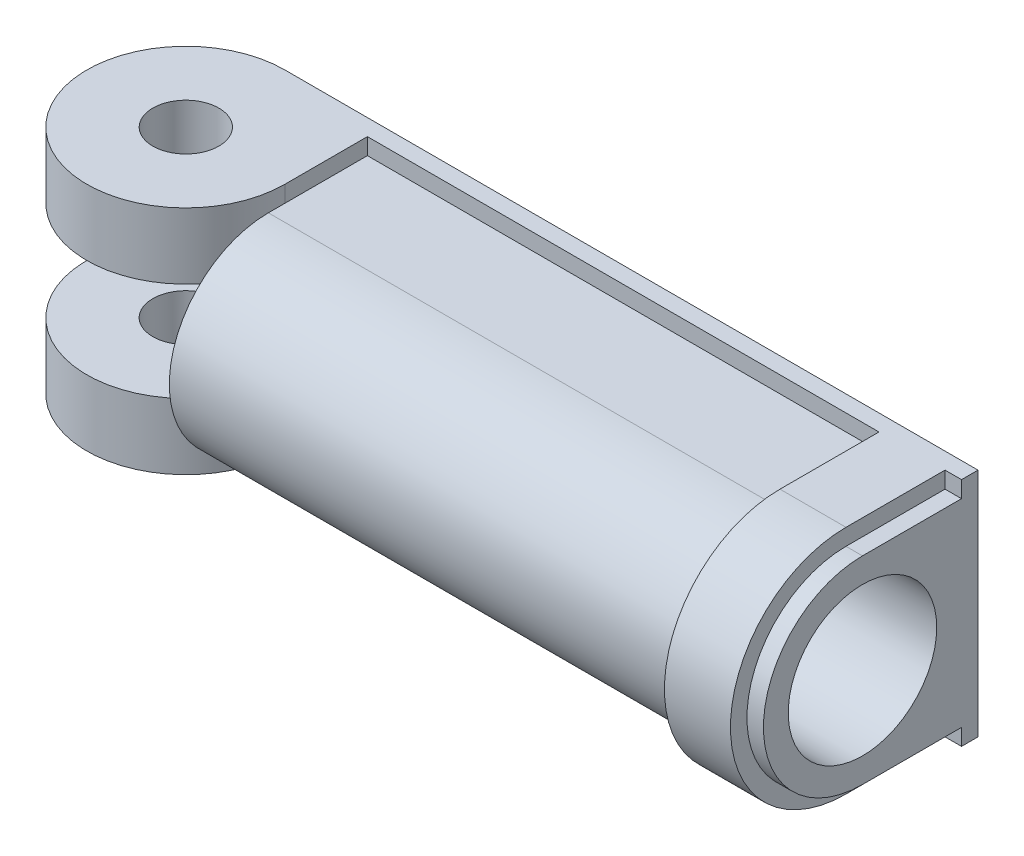
ISO-10303-21;
HEADER;
FILE_DESCRIPTION(('STEP AP214'),'2;1');
FILE_NAME('part.step','',(''),(''),'','','');
FILE_SCHEMA(('AUTOMOTIVE_DESIGN { 1 0 10303 214 1 1 1 1 }'));
ENDSEC;
DATA;
#1=APPLICATION_CONTEXT('core data for automotive mechanical design processes');
#2=APPLICATION_PROTOCOL_DEFINITION('international standard','automotive_design',2000,#1);
#3=PRODUCT_CONTEXT('',#1,'mechanical');
#4=PRODUCT('Part','Part','',(#3));
#5=PRODUCT_RELATED_PRODUCT_CATEGORY('part','',(#4));
#6=PRODUCT_DEFINITION_FORMATION('','',#4);
#7=PRODUCT_DEFINITION_CONTEXT('part definition',#1,'design');
#8=PRODUCT_DEFINITION('design','',#6,#7);
#9=PRODUCT_DEFINITION_SHAPE('','',#8);
#10=(LENGTH_UNIT() NAMED_UNIT(*) SI_UNIT(.MILLI.,.METRE.));
#11=(NAMED_UNIT(*) PLANE_ANGLE_UNIT() SI_UNIT($,.RADIAN.));
#12=(NAMED_UNIT(*) SI_UNIT($,.STERADIAN.) SOLID_ANGLE_UNIT());
#13=UNCERTAINTY_MEASURE_WITH_UNIT(LENGTH_MEASURE(1.E-05),#10,'distance_accuracy_value','');
#14=(GEOMETRIC_REPRESENTATION_CONTEXT(3) GLOBAL_UNCERTAINTY_ASSIGNED_CONTEXT((#13)) GLOBAL_UNIT_ASSIGNED_CONTEXT((#10,
#11,#12)) REPRESENTATION_CONTEXT('',''));
#15=CARTESIAN_POINT('',(0.,0.,0.));
#16=DIRECTION('',(0.,0.,1.));
#17=DIRECTION('',(1.,0.,0.));
#18=AXIS2_PLACEMENT_3D('',#15,#16,#17);
#19=CARTESIAN_POINT('',(-56.45658,10.97788,-10.97788));
#20=DIRECTION('',(0.,0.,-1.));
#21=DIRECTION('',(0.,1.,0.));
#22=AXIS2_PLACEMENT_3D('',#19,#20,#21);
#23=PLANE('',#22);
#24=DIRECTION('',(0.,-1.,0.));
#25=VECTOR('',#24,1.);
#26=CARTESIAN_POINT('',(-53.3945994739611,10.97788,-10.97788));
#27=LINE('',#26,#25);
#28=CARTESIAN_POINT('',(-53.3945994739611,3.71895707565416,-10.97788));
#29=VERTEX_POINT('',#28);
#30=CARTESIAN_POINT('',(-53.3945994739611,-10.97788,-10.97788));
#31=VERTEX_POINT('',#30);
#32=EDGE_CURVE('E406',#29,#31,#27,.T.);
#33=ORIENTED_EDGE('',*,*,#32,.F.);
#34=DIRECTION('',(0.500000000000005,0.866025403784436,0.));
#35=VECTOR('',#34,1.);
#36=CARTESIAN_POINT('',(-51.0168887771724,7.83727280819202,-10.97788));
#37=LINE('',#36,#35);
#38=CARTESIAN_POINT('',(-49.2036583695632,10.97788,-10.97788));
#39=VERTEX_POINT('',#38);
#40=EDGE_CURVE('E11',#29,#39,#37,.T.);
#41=ORIENTED_EDGE('',*,*,#40,.T.);
#42=DIRECTION('',(1.,0.,0.));
#43=VECTOR('',#42,1.);
#44=CARTESIAN_POINT('',(-56.45658,10.97788,-10.97788));
#45=LINE('',#44,#43);
#46=CARTESIAN_POINT('',(-40.3136583695632,10.97788,-10.97788));
#47=VERTEX_POINT('',#46);
#48=EDGE_CURVE('E372',#39,#47,#45,.T.);
#49=ORIENTED_EDGE('',*,*,#48,.T.);
#50=DIRECTION('',(0.500000000000005,0.866025403784436,0.));
#51=VECTOR('',#50,1.);
#52=CARTESIAN_POINT('',(-44.3493887771725,3.98778988837018,-10.97788));
#53=LINE('',#52,#51);
#54=CARTESIAN_POINT('',(-52.9898223158262,-10.97788,-10.97788));
#55=VERTEX_POINT('',#54);
#56=EDGE_CURVE('E45',#55,#47,#53,.T.);
#57=ORIENTED_EDGE('',*,*,#56,.F.);
#58=DIRECTION('',(1.,0.,0.));
#59=VECTOR('',#58,1.);
#60=CARTESIAN_POINT('',(-56.45658,-10.97788,-10.97788));
#61=LINE('',#60,#59);
#62=EDGE_CURVE('E377',#31,#55,#61,.T.);
#63=ORIENTED_EDGE('',*,*,#62,.F.);
#64=EDGE_LOOP('',(#33,#41,#49,#57,#63));
#65=FACE_BOUND('',#64,.T.);
#66=ADVANCED_FACE('F36',(#65),#23,.T.);
#67=CARTESIAN_POINT('',(-44.0998223158262,-10.97788,-10.97788));
#68=VERTEX_POINT('',#67);
#69=EDGE_CURVE('E378',#55,#68,#61,.T.);
#70=ORIENTED_EDGE('',*,*,#69,.F.);
#71=ORIENTED_EDGE('',*,*,#56,.T.);
#72=CARTESIAN_POINT('',(-31.4236583695632,10.97788,-10.97788));
#73=VERTEX_POINT('',#72);
#74=EDGE_CURVE('E442',#47,#73,#45,.T.);
#75=ORIENTED_EDGE('',*,*,#74,.T.);
#76=DIRECTION('',(0.500000000000005,0.866025403784436,0.));
#77=VECTOR('',#76,1.);
#78=CARTESIAN_POINT('',(-37.6818887771725,0.138306968548326,-10.97788));
#79=LINE('',#78,#77);
#80=EDGE_CURVE('E430',#68,#73,#79,.T.);
#81=ORIENTED_EDGE('',*,*,#80,.F.);
#82=EDGE_LOOP('',(#70,#71,#75,#81));
#83=FACE_BOUND('',#82,.T.);
#84=ADVANCED_FACE('F440',(#83),#23,.T.);
#85=CARTESIAN_POINT('',(-35.2098223158262,-10.97788,-10.97788));
#86=VERTEX_POINT('',#85);
#87=EDGE_CURVE('E518',#68,#86,#61,.T.);
#88=ORIENTED_EDGE('',*,*,#87,.F.);
#89=ORIENTED_EDGE('',*,*,#80,.T.);
#90=CARTESIAN_POINT('',(-22.5336583695632,10.97788,-10.97788));
#91=VERTEX_POINT('',#90);
#92=EDGE_CURVE('E450',#73,#91,#45,.T.);
#93=ORIENTED_EDGE('',*,*,#92,.T.);
#94=DIRECTION('',(0.500000000000005,0.866025403784436,0.));
#95=VECTOR('',#94,1.);
#96=CARTESIAN_POINT('',(-31.0143887771726,-3.71117595127353,-10.97788));
#97=LINE('',#96,#95);
#98=EDGE_CURVE('E426',#86,#91,#97,.T.);
#99=ORIENTED_EDGE('',*,*,#98,.F.);
#100=EDGE_LOOP('',(#88,#89,#93,#99));
#101=FACE_BOUND('',#100,.T.);
#102=ADVANCED_FACE('F532',(#101),#23,.T.);
#103=CARTESIAN_POINT('',(-26.3198223158262,-10.97788,-10.97788));
#104=VERTEX_POINT('',#103);
#105=EDGE_CURVE('E519',#86,#104,#61,.T.);
#106=ORIENTED_EDGE('',*,*,#105,.F.);
#107=ORIENTED_EDGE('',*,*,#98,.T.);
#108=CARTESIAN_POINT('',(-13.6436583695632,10.97788,-10.97788));
#109=VERTEX_POINT('',#108);
#110=EDGE_CURVE('E451',#91,#109,#45,.T.);
#111=ORIENTED_EDGE('',*,*,#110,.T.);
#112=DIRECTION('',(0.500000000000005,0.866025403784436,0.));
#113=VECTOR('',#112,1.);
#114=CARTESIAN_POINT('',(-24.3468887771726,-7.56065887109538,-10.97788));
#115=LINE('',#114,#113);
#116=EDGE_CURVE('E422',#104,#109,#115,.T.);
#117=ORIENTED_EDGE('',*,*,#116,.F.);
#118=EDGE_LOOP('',(#106,#107,#111,#117));
#119=FACE_BOUND('',#118,.T.);
#120=ADVANCED_FACE('F526',(#119),#23,.T.);
#121=CARTESIAN_POINT('',(-17.4298223158262,-10.97788,-10.97788));
#122=VERTEX_POINT('',#121);
#123=EDGE_CURVE('E517',#104,#122,#61,.T.);
#124=ORIENTED_EDGE('',*,*,#123,.F.);
#125=ORIENTED_EDGE('',*,*,#116,.T.);
#126=CARTESIAN_POINT('',(-4.75365836956324,10.97788,-10.97788));
#127=VERTEX_POINT('',#126);
#128=EDGE_CURVE('E454',#109,#127,#45,.T.);
#129=ORIENTED_EDGE('',*,*,#128,.T.);
#130=DIRECTION('',(0.500000000000005,0.866025403784436,0.));
#131=VECTOR('',#130,1.);
#132=CARTESIAN_POINT('',(-17.6793887771727,-11.4101417909172,-10.97788));
#133=LINE('',#132,#131);
#134=EDGE_CURVE('E418',#122,#127,#133,.T.);
#135=ORIENTED_EDGE('',*,*,#134,.F.);
#136=EDGE_LOOP('',(#124,#125,#129,#135));
#137=FACE_BOUND('',#136,.T.);
#138=ADVANCED_FACE('F524',(#137),#23,.T.);
#139=CARTESIAN_POINT('',(-8.53982231582622,-10.97788,-10.97788));
#140=VERTEX_POINT('',#139);
#141=EDGE_CURVE('E512',#122,#140,#61,.T.);
#142=ORIENTED_EDGE('',*,*,#141,.F.);
#143=ORIENTED_EDGE('',*,*,#134,.T.);
#144=CARTESIAN_POINT('',(0.,10.97788,-10.97788));
#145=VERTEX_POINT('',#144);
#146=EDGE_CURVE('E376',#127,#145,#45,.T.);
#147=ORIENTED_EDGE('',*,*,#146,.T.);
#148=DIRECTION('',(0.,1.,0.));
#149=VECTOR('',#148,1.);
#150=CARTESIAN_POINT('',(0.,10.97788,-10.97788));
#151=LINE('',#150,#149);
#152=CARTESIAN_POINT('',(0.,3.81352613862136,-10.97788));
#153=VERTEX_POINT('',#152);
#154=EDGE_CURVE('E364',#153,#145,#151,.T.);
#155=ORIENTED_EDGE('',*,*,#154,.F.);
#156=DIRECTION('',(0.500000000000005,0.866025403784436,0.));
#157=VECTOR('',#156,1.);
#158=CARTESIAN_POINT('',(-11.0118887771727,-15.2596247107391,-10.97788));
#159=LINE('',#158,#157);
#160=EDGE_CURVE('E415',#140,#153,#159,.T.);
#161=ORIENTED_EDGE('',*,*,#160,.F.);
#162=EDGE_LOOP('',(#142,#143,#147,#155,#161));
#163=FACE_BOUND('',#162,.T.);
#164=ADVANCED_FACE('F510',(#163),#23,.T.);
#165=CARTESIAN_POINT('',(0.,-10.97788,-10.97788));
#166=VERTEX_POINT('',#165);
#167=EDGE_CURVE('E381',#140,#166,#61,.T.);
#168=ORIENTED_EDGE('',*,*,#167,.F.);
#169=ORIENTED_EDGE('',*,*,#160,.T.);
#170=EDGE_CURVE('E330',#166,#153,#151,.T.);
#171=ORIENTED_EDGE('',*,*,#170,.F.);
#172=EDGE_LOOP('',(#168,#169,#171));
#173=FACE_BOUND('',#172,.T.);
#174=ADVANCED_FACE('F514',(#173),#23,.T.);
#175=CARTESIAN_POINT('',(-65.86728,10.97788,-10.97788));
#176=VERTEX_POINT('',#175);
#177=CARTESIAN_POINT('',(-53.3945994739611,10.97788,-10.97788));
#178=VERTEX_POINT('',#177);
#179=EDGE_CURVE('E367',#176,#178,#45,.T.);
#180=ORIENTED_EDGE('',*,*,#179,.T.);
#181=EDGE_CURVE('E411',#178,#29,#27,.T.);
#182=ORIENTED_EDGE('',*,*,#181,.T.);
#183=ORIENTED_EDGE('',*,*,#32,.T.);
#184=CARTESIAN_POINT('',(-65.86728,-10.97788,-10.97788));
#185=VERTEX_POINT('',#184);
#186=EDGE_CURVE('E373',#185,#31,#61,.T.);
#187=ORIENTED_EDGE('',*,*,#186,.F.);
#188=DIRECTION('',(0.,-1.,0.));
#189=VECTOR('',#188,1.);
#190=CARTESIAN_POINT('',(-65.86728,-4.70408,-10.97788));
#191=LINE('',#190,#189);
#192=CARTESIAN_POINT('',(-65.86728,-4.70408,-10.97788));
#193=VERTEX_POINT('',#192);
#194=EDGE_CURVE('E244',#193,#185,#191,.T.);
#195=ORIENTED_EDGE('',*,*,#194,.F.);
#196=DIRECTION('',(-1.,0.,0.));
#197=VECTOR('',#196,1.);
#198=CARTESIAN_POINT('',(-56.45658,-4.70408,-10.97788));
#199=LINE('',#198,#197);
#200=CARTESIAN_POINT('',(-56.45658,-4.70408,-10.97788));
#201=VERTEX_POINT('',#200);
#202=EDGE_CURVE('E230',#201,#193,#199,.T.);
#203=ORIENTED_EDGE('',*,*,#202,.F.);
#204=DIRECTION('',(0.,1.,0.));
#205=VECTOR('',#204,1.);
#206=CARTESIAN_POINT('',(-56.45658,10.97788,-10.97788));
#207=LINE('',#206,#205);
#208=CARTESIAN_POINT('',(-56.45658,4.70408,-10.97788));
#209=VERTEX_POINT('',#208);
#210=EDGE_CURVE('E248',#201,#209,#207,.T.);
#211=ORIENTED_EDGE('',*,*,#210,.T.);
#212=DIRECTION('',(-1.,0.,0.));
#213=VECTOR('',#212,1.);
#214=CARTESIAN_POINT('',(-56.45658,4.70408,-10.97788));
#215=LINE('',#214,#213);
#216=CARTESIAN_POINT('',(-65.86728,4.70408,-10.97788));
#217=VERTEX_POINT('',#216);
#218=EDGE_CURVE('E266',#209,#217,#215,.T.);
#219=ORIENTED_EDGE('',*,*,#218,.T.);
#220=DIRECTION('',(0.,1.,0.));
#221=VECTOR('',#220,1.);
#222=CARTESIAN_POINT('',(-65.86728,4.70408,-10.97788));
#223=LINE('',#222,#221);
#224=EDGE_CURVE('E273',#217,#176,#223,.T.);
#225=ORIENTED_EDGE('',*,*,#224,.T.);
#226=EDGE_LOOP('',(#180,#182,#183,#187,#195,#203,#211,#219,#225));
#227=FACE_BOUND('',#226,.T.);
#228=ADVANCED_FACE('F466',(#227),#23,.T.);
#229=CARTESIAN_POINT('',(-56.45658,0.,0.));
#230=DIRECTION('',(1.,0.,0.));
#231=DIRECTION('',(0.,0.,-1.));
#232=AXIS2_PLACEMENT_3D('',#229,#230,#231);
#233=PLANE('',#232);
#234=DIRECTION('',(0.,-1.,0.));
#235=VECTOR('',#234,1.);
#236=CARTESIAN_POINT('',(-56.45658,-4.70408,-1.56718));
#237=LINE('',#236,#235);
#238=CARTESIAN_POINT('',(-56.45658,-4.70408,-1.56718));
#239=VERTEX_POINT('',#238);
#240=CARTESIAN_POINT('',(-56.45658,-9.4107,-1.56718));
#241=VERTEX_POINT('',#240);
#242=EDGE_CURVE('E237',#239,#241,#237,.T.);
#243=ORIENTED_EDGE('',*,*,#242,.T.);
#244=DIRECTION('',(0.,0.,-1.));
#245=VECTOR('',#244,1.);
#246=CARTESIAN_POINT('',(-56.45658,-9.4107,0.));
#247=LINE('',#246,#245);
#248=CARTESIAN_POINT('',(-56.45658,-9.4107,0.));
#249=VERTEX_POINT('',#248);
#250=EDGE_CURVE('E337',#249,#241,#247,.T.);
#251=ORIENTED_EDGE('',*,*,#250,.F.);
#252=CARTESIAN_POINT('',(-56.45658,0.,0.));
#253=DIRECTION('',(1.,0.,0.));
#254=DIRECTION('',(0.,0.,-1.));
#255=AXIS2_PLACEMENT_3D('',#252,#253,#254);
#256=CIRCLE('',#255,9.4107);
#257=CARTESIAN_POINT('',(-56.45658,9.4107,0.));
#258=VERTEX_POINT('',#257);
#259=EDGE_CURVE('E334',#258,#249,#256,.T.);
#260=ORIENTED_EDGE('',*,*,#259,.F.);
#261=DIRECTION('',(0.,0.,1.));
#262=VECTOR('',#261,1.);
#263=CARTESIAN_POINT('',(-56.45658,9.4107,0.));
#264=LINE('',#263,#262);
#265=CARTESIAN_POINT('',(-56.45658,9.4107,-1.56718));
#266=VERTEX_POINT('',#265);
#267=EDGE_CURVE('E329',#266,#258,#264,.T.);
#268=ORIENTED_EDGE('',*,*,#267,.F.);
#269=DIRECTION('',(0.,1.,0.));
#270=VECTOR('',#269,1.);
#271=CARTESIAN_POINT('',(-56.45658,4.70408,-1.56718));
#272=LINE('',#271,#270);
#273=CARTESIAN_POINT('',(-56.45658,4.70408,-1.56718));
#274=VERTEX_POINT('',#273);
#275=EDGE_CURVE('E277',#274,#266,#272,.T.);
#276=ORIENTED_EDGE('',*,*,#275,.F.);
#277=DIRECTION('',(0.,0.,-1.));
#278=VECTOR('',#277,1.);
#279=CARTESIAN_POINT('',(-56.45658,4.70408,-1.56718));
#280=LINE('',#279,#278);
#281=EDGE_CURVE('E264',#274,#209,#280,.T.);
#282=ORIENTED_EDGE('',*,*,#281,.T.);
#283=ORIENTED_EDGE('',*,*,#210,.F.);
#284=DIRECTION('',(0.,0.,-1.));
#285=VECTOR('',#284,1.);
#286=CARTESIAN_POINT('',(-56.45658,-4.70408,-1.56718));
#287=LINE('',#286,#285);
#288=EDGE_CURVE('E228',#239,#201,#287,.T.);
#289=ORIENTED_EDGE('',*,*,#288,.F.);
#290=EDGE_LOOP('',(#243,#251,#260,#268,#276,#282,#283,#289));
#291=FACE_BOUND('',#290,.T.);
#292=ADVANCED_FACE('F246',(#291),#233,.F.);
#293=CARTESIAN_POINT('',(-56.45658,-9.4107,-9.41069999999999));
#294=DIRECTION('',(0.,0.,1.));
#295=DIRECTION('',(1.,0.,0.));
#296=AXIS2_PLACEMENT_3D('',#293,#294,#295);
#297=PLANE('',#296);
#298=DIRECTION('',(1.,0.,0.));
#299=VECTOR('',#298,1.);
#300=CARTESIAN_POINT('',(-56.45658,-10.97788,-9.41069999999999));
#301=LINE('',#300,#299);
#302=CARTESIAN_POINT('',(-56.45658,-10.97788,-9.41069999999999));
#303=VERTEX_POINT('',#302);
#304=CARTESIAN_POINT('',(-7.84098,-10.97788,-9.41069999999999));
#305=VERTEX_POINT('',#304);
#306=EDGE_CURVE('E379',#303,#305,#301,.T.);
#307=ORIENTED_EDGE('',*,*,#306,.T.);
#308=DIRECTION('',(0.,1.,0.));
#309=VECTOR('',#308,1.);
#310=CARTESIAN_POINT('',(-7.84098,10.97788,-9.41069999999999));
#311=LINE('',#310,#309);
#312=CARTESIAN_POINT('',(-7.84098,-9.4107,-9.41069999999999));
#313=VERTEX_POINT('',#312);
#314=EDGE_CURVE('E284',#305,#313,#311,.T.);
#315=ORIENTED_EDGE('',*,*,#314,.T.);
#316=DIRECTION('',(1.,0.,0.));
#317=VECTOR('',#316,1.);
#318=CARTESIAN_POINT('',(-56.45658,-9.4107,-9.41069999999999));
#319=LINE('',#318,#317);
#320=CARTESIAN_POINT('',(-56.45658,-9.4107,-9.41069999999999));
#321=VERTEX_POINT('',#320);
#322=EDGE_CURVE('E383',#321,#313,#319,.T.);
#323=ORIENTED_EDGE('',*,*,#322,.F.);
#324=DIRECTION('',(0.,-1.,0.));
#325=VECTOR('',#324,1.);
#326=CARTESIAN_POINT('',(-56.45658,-9.4107,-9.41069999999999));
#327=LINE('',#326,#325);
#328=EDGE_CURVE('E339',#321,#303,#327,.T.);
#329=ORIENTED_EDGE('',*,*,#328,.T.);
#330=EDGE_LOOP('',(#307,#315,#323,#329));
#331=FACE_BOUND('',#330,.T.);
#332=ADVANCED_FACE('F552',(#331),#297,.T.);
#333=CARTESIAN_POINT('',(-56.45658,-9.4107,0.));
#334=DIRECTION('',(0.,-1.,0.));
#335=DIRECTION('',(0.,0.,-1.));
#336=AXIS2_PLACEMENT_3D('',#333,#334,#335);
#337=PLANE('',#336);
#338=ORIENTED_EDGE('',*,*,#322,.T.);
#339=DIRECTION('',(0.,0.,1.));
#340=VECTOR('',#339,1.);
#341=CARTESIAN_POINT('',(-7.84098,-9.4107,0.));
#342=LINE('',#341,#340);
#343=CARTESIAN_POINT('',(-7.84098,-9.4107,0.));
#344=VERTEX_POINT('',#343);
#345=EDGE_CURVE('E323',#313,#344,#342,.T.);
#346=ORIENTED_EDGE('',*,*,#345,.T.);
#347=DIRECTION('',(1.,0.,0.));
#348=VECTOR('',#347,1.);
#349=CARTESIAN_POINT('',(-56.45658,-9.4107,0.));
#350=LINE('',#349,#348);
#351=EDGE_CURVE('E387',#249,#344,#350,.T.);
#352=ORIENTED_EDGE('',*,*,#351,.F.);
#353=ORIENTED_EDGE('',*,*,#250,.T.);
#354=DIRECTION('',(0.,0.,-1.));
#355=VECTOR('',#354,1.);
#356=CARTESIAN_POINT('',(-56.45658,-9.4107,0.));
#357=LINE('',#356,#355);
#358=EDGE_CURVE('E259',#241,#321,#357,.T.);
#359=ORIENTED_EDGE('',*,*,#358,.T.);
#360=EDGE_LOOP('',(#338,#346,#352,#353,#359));
#361=FACE_BOUND('',#360,.T.);
#362=ADVANCED_FACE('F617',(#361),#337,.T.);
#363=CARTESIAN_POINT('',(-56.45658,0.,0.));
#364=DIRECTION('',(1.,0.,0.));
#365=DIRECTION('',(0.,0.,-1.));
#366=AXIS2_PLACEMENT_3D('',#363,#364,#365);
#367=CYLINDRICAL_SURFACE('',#366,9.4107);
#368=ORIENTED_EDGE('',*,*,#351,.T.);
#369=CARTESIAN_POINT('',(-7.84098,0.,0.));
#370=DIRECTION('',(1.,0.,0.));
#371=DIRECTION('',(0.,0.,-1.));
#372=AXIS2_PLACEMENT_3D('',#369,#370,#371);
#373=CIRCLE('',#372,9.4107);
#374=CARTESIAN_POINT('',(-7.84098,9.4107,0.));
#375=VERTEX_POINT('',#374);
#376=EDGE_CURVE('E321',#344,#375,#373,.F.);
#377=ORIENTED_EDGE('',*,*,#376,.T.);
#378=DIRECTION('',(1.,0.,0.));
#379=VECTOR('',#378,1.);
#380=CARTESIAN_POINT('',(-56.45658,9.4107,0.));
#381=LINE('',#380,#379);
#382=EDGE_CURVE('E391',#258,#375,#381,.T.);
#383=ORIENTED_EDGE('',*,*,#382,.F.);
#384=ORIENTED_EDGE('',*,*,#259,.T.);
#385=EDGE_LOOP('',(#368,#377,#383,#384));
#386=FACE_BOUND('',#385,.T.);
#387=ADVANCED_FACE('F608',(#386),#367,.T.);
#388=CARTESIAN_POINT('',(-56.45658,9.4107,0.));
#389=DIRECTION('',(0.,1.,0.));
#390=DIRECTION('',(0.,0.,1.));
#391=AXIS2_PLACEMENT_3D('',#388,#389,#390);
#392=PLANE('',#391);
#393=ORIENTED_EDGE('',*,*,#382,.T.);
#394=DIRECTION('',(0.,0.,-1.));
#395=VECTOR('',#394,1.);
#396=CARTESIAN_POINT('',(-7.84098,9.4107,0.));
#397=LINE('',#396,#395);
#398=CARTESIAN_POINT('',(-7.84098,9.4107,-9.41069999999999));
#399=VERTEX_POINT('',#398);
#400=EDGE_CURVE('E319',#375,#399,#397,.T.);
#401=ORIENTED_EDGE('',*,*,#400,.T.);
#402=DIRECTION('',(1.,0.,0.));
#403=VECTOR('',#402,1.);
#404=CARTESIAN_POINT('',(-56.45658,9.4107,-9.41069999999999));
#405=LINE('',#404,#403);
#406=CARTESIAN_POINT('',(-56.45658,9.4107,-9.41069999999999));
#407=VERTEX_POINT('',#406);
#408=EDGE_CURVE('E395',#407,#399,#405,.T.);
#409=ORIENTED_EDGE('',*,*,#408,.F.);
#410=EDGE_CURVE('E331',#407,#266,#264,.T.);
#411=ORIENTED_EDGE('',*,*,#410,.T.);
#412=ORIENTED_EDGE('',*,*,#267,.T.);
#413=EDGE_LOOP('',(#393,#401,#409,#411,#412));
#414=FACE_BOUND('',#413,.T.);
#415=ADVANCED_FACE('F601',(#414),#392,.T.);
#416=CARTESIAN_POINT('',(-56.45658,10.97788,-9.41069999999999));
#417=DIRECTION('',(0.,0.,1.));
#418=DIRECTION('',(1.,0.,0.));
#419=AXIS2_PLACEMENT_3D('',#416,#417,#418);
#420=PLANE('',#419);
#421=ORIENTED_EDGE('',*,*,#408,.T.);
#422=DIRECTION('',(0.,1.,0.));
#423=VECTOR('',#422,1.);
#424=CARTESIAN_POINT('',(-7.84098,10.97788,-9.41069999999999));
#425=LINE('',#424,#423);
#426=CARTESIAN_POINT('',(-7.84098,10.97788,-9.41069999999999));
#427=VERTEX_POINT('',#426);
#428=EDGE_CURVE('E404',#399,#427,#425,.T.);
#429=ORIENTED_EDGE('',*,*,#428,.T.);
#430=DIRECTION('',(1.,0.,0.));
#431=VECTOR('',#430,1.);
#432=CARTESIAN_POINT('',(-56.45658,10.97788,-9.41069999999999));
#433=LINE('',#432,#431);
#434=CARTESIAN_POINT('',(-56.45658,10.97788,-9.41069999999999));
#435=VERTEX_POINT('',#434);
#436=EDGE_CURVE('E399',#435,#427,#433,.T.);
#437=ORIENTED_EDGE('',*,*,#436,.F.);
#438=DIRECTION('',(0.,-1.,0.));
#439=VECTOR('',#438,1.);
#440=CARTESIAN_POINT('',(-56.45658,10.97788,-9.41069999999999));
#441=LINE('',#440,#439);
#442=EDGE_CURVE('E326',#435,#407,#441,.T.);
#443=ORIENTED_EDGE('',*,*,#442,.T.);
#444=EDGE_LOOP('',(#421,#429,#437,#443));
#445=FACE_BOUND('',#444,.T.);
#446=ADVANCED_FACE('F480',(#445),#420,.T.);
#447=CARTESIAN_POINT('',(-56.45658,10.97788,-10.97788));
#448=DIRECTION('',(0.,1.,0.));
#449=DIRECTION('',(0.,0.,1.));
#450=AXIS2_PLACEMENT_3D('',#447,#448,#449);
#451=PLANE('',#450);
#452=CARTESIAN_POINT('',(-65.86728,10.97788,-1.56718));
#453=DIRECTION('',(0.,1.,0.));
#454=DIRECTION('',(0.,0.,1.));
#455=AXIS2_PLACEMENT_3D('',#452,#453,#454);
#456=CIRCLE('',#455,3.13689999999999);
#457=CARTESIAN_POINT('',(-65.86728,10.97788,1.56971999999999));
#458=VERTEX_POINT('',#457);
#459=EDGE_CURVE('E885',#458,#458,#456,.T.);
#460=ORIENTED_EDGE('',*,*,#459,.F.);
#461=EDGE_LOOP('',(#460));
#462=FACE_BOUND('',#461,.T.);
#463=DIRECTION('',(0.,0.,1.));
#464=VECTOR('',#463,1.);
#465=CARTESIAN_POINT('',(0.,10.97788,-10.97788));
#466=LINE('',#465,#464);
#467=CARTESIAN_POINT('',(0.,10.97788,-9.41069999999999));
#468=VERTEX_POINT('',#467);
#469=EDGE_CURVE('E325',#145,#468,#466,.T.);
#470=ORIENTED_EDGE('',*,*,#469,.F.);
#471=ORIENTED_EDGE('',*,*,#146,.F.);
#472=ORIENTED_EDGE('',*,*,#128,.F.);
#473=ORIENTED_EDGE('',*,*,#110,.F.);
#474=ORIENTED_EDGE('',*,*,#92,.F.);
#475=ORIENTED_EDGE('',*,*,#74,.F.);
#476=ORIENTED_EDGE('',*,*,#48,.F.);
#477=EDGE_CURVE('E371',#178,#39,#45,.T.);
#478=ORIENTED_EDGE('',*,*,#477,.F.);
#479=ORIENTED_EDGE('',*,*,#179,.F.);
#480=CARTESIAN_POINT('',(-65.86728,10.97788,-1.56718));
#481=DIRECTION('',(0.,1.,0.));
#482=DIRECTION('',(0.,0.,1.));
#483=AXIS2_PLACEMENT_3D('',#480,#481,#482);
#484=CIRCLE('',#483,9.41069999999999);
#485=CARTESIAN_POINT('',(-56.45658,10.97788,-1.56718));
#486=VERTEX_POINT('',#485);
#487=EDGE_CURVE('E267',#176,#486,#484,.T.);
#488=ORIENTED_EDGE('',*,*,#487,.T.);
#489=DIRECTION('',(0.,0.,-1.));
#490=VECTOR('',#489,1.);
#491=CARTESIAN_POINT('',(-56.45658,10.97788,-1.56718));
#492=LINE('',#491,#490);
#493=EDGE_CURVE('E263',#486,#435,#492,.T.);
#494=ORIENTED_EDGE('',*,*,#493,.T.);
#495=ORIENTED_EDGE('',*,*,#436,.T.);
#496=DIRECTION('',(0.,0.,1.));
#497=VECTOR('',#496,1.);
#498=CARTESIAN_POINT('',(-7.84098,10.97788,-9.41069999999999));
#499=LINE('',#498,#497);
#500=CARTESIAN_POINT('',(-7.84098,10.97788,0.));
#501=VERTEX_POINT('',#500);
#502=EDGE_CURVE('E286',#427,#501,#499,.T.);
#503=ORIENTED_EDGE('',*,*,#502,.T.);
#504=DIRECTION('',(1.,0.,0.));
#505=VECTOR('',#504,1.);
#506=CARTESIAN_POINT('',(-7.84098,10.97788,0.));
#507=LINE('',#506,#505);
#508=CARTESIAN_POINT('',(-1.56718,10.97788,0.));
#509=VERTEX_POINT('',#508);
#510=EDGE_CURVE('E296',#501,#509,#507,.T.);
#511=ORIENTED_EDGE('',*,*,#510,.T.);
#512=DIRECTION('',(0.,0.,1.));
#513=VECTOR('',#512,1.);
#514=CARTESIAN_POINT('',(-1.56718,10.97788,-9.41069999999999));
#515=LINE('',#514,#513);
#516=CARTESIAN_POINT('',(-1.56718,10.97788,-9.41069999999999));
#517=VERTEX_POINT('',#516);
#518=EDGE_CURVE('E299',#517,#509,#515,.T.);
#519=ORIENTED_EDGE('',*,*,#518,.F.);
#520=EDGE_CURVE('E343',#517,#468,#433,.T.);
#521=ORIENTED_EDGE('',*,*,#520,.T.);
#522=EDGE_LOOP('',(#470,#471,#472,#473,#474,#475,#476,#478,#479,#488,#494,#495,#503,#511,#519,#521));
#523=FACE_BOUND('',#522,.T.);
#524=ADVANCED_FACE('F38',(#462,#523),#451,.T.);
#525=ORIENTED_EDGE('',*,*,#40,.F.);
#526=ORIENTED_EDGE('',*,*,#181,.F.);
#527=ORIENTED_EDGE('',*,*,#477,.T.);
#528=EDGE_LOOP('',(#525,#526,#527));
#529=FACE_BOUND('',#528,.T.);
#530=ADVANCED_FACE('F464',(#529),#23,.T.);
#531=CARTESIAN_POINT('',(-56.45658,-10.97788,-10.97788));
#532=DIRECTION('',(0.,-1.,0.));
#533=DIRECTION('',(0.,0.,-1.));
#534=AXIS2_PLACEMENT_3D('',#531,#532,#533);
#535=PLANE('',#534);
#536=CARTESIAN_POINT('',(-65.86728,-10.97788,-1.56718));
#537=DIRECTION('',(0.,1.,0.));
#538=DIRECTION('',(0.,0.,1.));
#539=AXIS2_PLACEMENT_3D('',#536,#537,#538);
#540=CIRCLE('',#539,3.13689999999999);
#541=CARTESIAN_POINT('',(-65.86728,-10.97788,1.56971999999999));
#542=VERTEX_POINT('',#541);
#543=EDGE_CURVE('E410',#542,#542,#540,.T.);
#544=ORIENTED_EDGE('',*,*,#543,.T.);
#545=EDGE_LOOP('',(#544));
#546=FACE_BOUND('',#545,.T.);
#547=DIRECTION('',(0.,0.,-1.));
#548=VECTOR('',#547,1.);
#549=CARTESIAN_POINT('',(0.,-10.97788,-10.97788));
#550=LINE('',#549,#548);
#551=CARTESIAN_POINT('',(0.,-10.97788,-9.41069999999999));
#552=VERTEX_POINT('',#551);
#553=EDGE_CURVE('E361',#552,#166,#550,.T.);
#554=ORIENTED_EDGE('',*,*,#553,.F.);
#555=CARTESIAN_POINT('',(-1.56718,-10.97788,-9.41069999999999));
#556=VERTEX_POINT('',#555);
#557=EDGE_CURVE('E382',#556,#552,#301,.T.);
#558=ORIENTED_EDGE('',*,*,#557,.F.);
#559=DIRECTION('',(0.,0.,-1.));
#560=VECTOR('',#559,1.);
#561=CARTESIAN_POINT('',(-1.56718,-10.97788,-9.41069999999999));
#562=LINE('',#561,#560);
#563=CARTESIAN_POINT('',(-1.56718,-10.97788,0.));
#564=VERTEX_POINT('',#563);
#565=EDGE_CURVE('E287',#564,#556,#562,.T.);
#566=ORIENTED_EDGE('',*,*,#565,.F.);
#567=DIRECTION('',(1.,0.,0.));
#568=VECTOR('',#567,1.);
#569=CARTESIAN_POINT('',(-7.84098,-10.97788,0.));
#570=LINE('',#569,#568);
#571=CARTESIAN_POINT('',(-7.84098,-10.97788,0.));
#572=VERTEX_POINT('',#571);
#573=EDGE_CURVE('E307',#572,#564,#570,.T.);
#574=ORIENTED_EDGE('',*,*,#573,.F.);
#575=DIRECTION('',(0.,0.,-1.));
#576=VECTOR('',#575,1.);
#577=CARTESIAN_POINT('',(-7.84098,-10.97788,-9.41069999999999));
#578=LINE('',#577,#576);
#579=EDGE_CURVE('E293',#572,#305,#578,.T.);
#580=ORIENTED_EDGE('',*,*,#579,.T.);
#581=ORIENTED_EDGE('',*,*,#306,.F.);
#582=DIRECTION('',(0.,0.,-1.));
#583=VECTOR('',#582,1.);
#584=CARTESIAN_POINT('',(-56.45658,-10.97788,-1.56718));
#585=LINE('',#584,#583);
#586=CARTESIAN_POINT('',(-56.45658,-10.97788,-1.56718));
#587=VERTEX_POINT('',#586);
#588=EDGE_CURVE('E251',#587,#303,#585,.T.);
#589=ORIENTED_EDGE('',*,*,#588,.F.);
#590=CARTESIAN_POINT('',(-65.86728,-10.97788,-1.56718));
#591=DIRECTION('',(0.,1.,0.));
#592=DIRECTION('',(0.,0.,1.));
#593=AXIS2_PLACEMENT_3D('',#590,#591,#592);
#594=CIRCLE('',#593,9.41069999999999);
#595=EDGE_CURVE('E249',#185,#587,#594,.T.);
#596=ORIENTED_EDGE('',*,*,#595,.F.);
#597=ORIENTED_EDGE('',*,*,#186,.T.);
#598=ORIENTED_EDGE('',*,*,#62,.T.);
#599=ORIENTED_EDGE('',*,*,#69,.T.);
#600=ORIENTED_EDGE('',*,*,#87,.T.);
#601=ORIENTED_EDGE('',*,*,#105,.T.);
#602=ORIENTED_EDGE('',*,*,#123,.T.);
#603=ORIENTED_EDGE('',*,*,#141,.T.);
#604=ORIENTED_EDGE('',*,*,#167,.T.);
#605=EDGE_LOOP('',(#554,#558,#566,#574,#580,#581,#589,#596,#597,#598,#599,#600,#601,#602,#603,#604));
#606=FACE_BOUND('',#605,.T.);
#607=ADVANCED_FACE('F523',(#546,#606),#535,.T.);
#608=DIRECTION('',(0.,1.,0.));
#609=VECTOR('',#608,1.);
#610=CARTESIAN_POINT('',(-1.56718,10.97788,-9.41069999999999));
#611=LINE('',#610,#609);
#612=CARTESIAN_POINT('',(-1.56718,-9.4107,-9.41069999999999));
#613=VERTEX_POINT('',#612);
#614=EDGE_CURVE('E280',#556,#613,#611,.T.);
#615=ORIENTED_EDGE('',*,*,#614,.F.);
#616=ORIENTED_EDGE('',*,*,#557,.T.);
#617=DIRECTION('',(0.,-1.,0.));
#618=VECTOR('',#617,1.);
#619=CARTESIAN_POINT('',(0.,-9.4107,-9.41069999999999));
#620=LINE('',#619,#618);
#621=CARTESIAN_POINT('',(0.,-9.4107,-9.41069999999999));
#622=VERTEX_POINT('',#621);
#623=EDGE_CURVE('E358',#622,#552,#620,.T.);
#624=ORIENTED_EDGE('',*,*,#623,.F.);
#625=EDGE_CURVE('E386',#613,#622,#319,.T.);
#626=ORIENTED_EDGE('',*,*,#625,.F.);
#627=EDGE_LOOP('',(#615,#616,#624,#626));
#628=FACE_BOUND('',#627,.T.);
#629=ADVANCED_FACE('F544',(#628),#297,.T.);
#630=DIRECTION('',(0.,0.,1.));
#631=VECTOR('',#630,1.);
#632=CARTESIAN_POINT('',(-1.56718,-9.4107,0.));
#633=LINE('',#632,#631);
#634=CARTESIAN_POINT('',(-1.56718,-9.4107,0.));
#635=VERTEX_POINT('',#634);
#636=EDGE_CURVE('E316',#613,#635,#633,.T.);
#637=ORIENTED_EDGE('',*,*,#636,.F.);
#638=ORIENTED_EDGE('',*,*,#625,.T.);
#639=DIRECTION('',(0.,0.,-1.));
#640=VECTOR('',#639,1.);
#641=CARTESIAN_POINT('',(0.,-9.4107,0.));
#642=LINE('',#641,#640);
#643=CARTESIAN_POINT('',(0.,-9.4107,0.));
#644=VERTEX_POINT('',#643);
#645=EDGE_CURVE('E355',#644,#622,#642,.T.);
#646=ORIENTED_EDGE('',*,*,#645,.F.);
#647=EDGE_CURVE('E390',#635,#644,#350,.T.);
#648=ORIENTED_EDGE('',*,*,#647,.F.);
#649=EDGE_LOOP('',(#637,#638,#646,#648));
#650=FACE_BOUND('',#649,.T.);
#651=ADVANCED_FACE('F629',(#650),#337,.T.);
#652=CARTESIAN_POINT('',(-1.56718,0.,0.));
#653=DIRECTION('',(1.,0.,0.));
#654=DIRECTION('',(0.,0.,-1.));
#655=AXIS2_PLACEMENT_3D('',#652,#653,#654);
#656=CIRCLE('',#655,9.4107);
#657=CARTESIAN_POINT('',(-1.56718,9.4107,0.));
#658=VERTEX_POINT('',#657);
#659=EDGE_CURVE('E313',#635,#658,#656,.F.);
#660=ORIENTED_EDGE('',*,*,#659,.F.);
#661=ORIENTED_EDGE('',*,*,#647,.T.);
#662=CARTESIAN_POINT('',(0.,0.,0.));
#663=DIRECTION('',(1.,0.,0.));
#664=DIRECTION('',(0.,0.,-1.));
#665=AXIS2_PLACEMENT_3D('',#662,#663,#664);
#666=CIRCLE('',#665,9.4107);
#667=CARTESIAN_POINT('',(0.,9.4107,0.));
#668=VERTEX_POINT('',#667);
#669=EDGE_CURVE('E352',#668,#644,#666,.T.);
#670=ORIENTED_EDGE('',*,*,#669,.F.);
#671=EDGE_CURVE('E394',#658,#668,#381,.T.);
#672=ORIENTED_EDGE('',*,*,#671,.F.);
#673=EDGE_LOOP('',(#660,#661,#670,#672));
#674=FACE_BOUND('',#673,.T.);
#675=ADVANCED_FACE('F620',(#674),#367,.T.);
#676=DIRECTION('',(0.,0.,-1.));
#677=VECTOR('',#676,1.);
#678=CARTESIAN_POINT('',(-1.56718,9.4107,0.));
#679=LINE('',#678,#677);
#680=CARTESIAN_POINT('',(-1.56718,9.4107,-9.41069999999999));
#681=VERTEX_POINT('',#680);
#682=EDGE_CURVE('E309',#658,#681,#679,.T.);
#683=ORIENTED_EDGE('',*,*,#682,.F.);
#684=ORIENTED_EDGE('',*,*,#671,.T.);
#685=DIRECTION('',(0.,0.,1.));
#686=VECTOR('',#685,1.);
#687=CARTESIAN_POINT('',(0.,9.4107,0.));
#688=LINE('',#687,#686);
#689=CARTESIAN_POINT('',(0.,9.4107,-9.41069999999999));
#690=VERTEX_POINT('',#689);
#691=EDGE_CURVE('E349',#690,#668,#688,.T.);
#692=ORIENTED_EDGE('',*,*,#691,.F.);
#693=EDGE_CURVE('E398',#681,#690,#405,.T.);
#694=ORIENTED_EDGE('',*,*,#693,.F.);
#695=EDGE_LOOP('',(#683,#684,#692,#694));
#696=FACE_BOUND('',#695,.T.);
#697=ADVANCED_FACE('F502',(#696),#392,.T.);
#698=DIRECTION('',(0.,1.,0.));
#699=VECTOR('',#698,1.);
#700=CARTESIAN_POINT('',(-1.56718,10.97788,-9.41069999999999));
#701=LINE('',#700,#699);
#702=EDGE_CURVE('E370',#681,#517,#701,.T.);
#703=ORIENTED_EDGE('',*,*,#702,.F.);
#704=ORIENTED_EDGE('',*,*,#693,.T.);
#705=DIRECTION('',(0.,-1.,0.));
#706=VECTOR('',#705,1.);
#707=CARTESIAN_POINT('',(0.,10.97788,-9.41069999999999));
#708=LINE('',#707,#706);
#709=EDGE_CURVE('E346',#468,#690,#708,.T.);
#710=ORIENTED_EDGE('',*,*,#709,.F.);
#711=ORIENTED_EDGE('',*,*,#520,.F.);
#712=EDGE_LOOP('',(#703,#704,#710,#711));
#713=FACE_BOUND('',#712,.T.);
#714=ADVANCED_FACE('F498',(#713),#420,.T.);
#715=CARTESIAN_POINT('',(0.,0.,0.));
#716=DIRECTION('',(1.,0.,0.));
#717=DIRECTION('',(0.,0.,-1.));
#718=AXIS2_PLACEMENT_3D('',#715,#716,#717);
#719=PLANE('',#718);
#720=CARTESIAN_POINT('',(0.,0.,0.));
#721=DIRECTION('',(1.,0.,0.));
#722=DIRECTION('',(0.,0.,-1.));
#723=AXIS2_PLACEMENT_3D('',#720,#721,#722);
#724=CIRCLE('',#723,7.05612);
#725=CARTESIAN_POINT('',(0.,0.,-7.05612));
#726=VERTEX_POINT('',#725);
#727=EDGE_CURVE('E886',#726,#726,#724,.T.);
#728=ORIENTED_EDGE('',*,*,#727,.F.);
#729=EDGE_LOOP('',(#728));
#730=FACE_BOUND('',#729,.T.);
#731=ORIENTED_EDGE('',*,*,#469,.T.);
#732=ORIENTED_EDGE('',*,*,#709,.T.);
#733=ORIENTED_EDGE('',*,*,#691,.T.);
#734=ORIENTED_EDGE('',*,*,#669,.T.);
#735=ORIENTED_EDGE('',*,*,#645,.T.);
#736=ORIENTED_EDGE('',*,*,#623,.T.);
#737=ORIENTED_EDGE('',*,*,#553,.T.);
#738=ORIENTED_EDGE('',*,*,#170,.T.);
#739=ORIENTED_EDGE('',*,*,#154,.T.);
#740=EDGE_LOOP('',(#731,#732,#733,#734,#735,#736,#737,#738,#739));
#741=FACE_BOUND('',#740,.T.);
#742=ADVANCED_FACE('F506',(#730,#741),#719,.T.);
#743=CARTESIAN_POINT('',(-7.84098,0.,0.));
#744=DIRECTION('',(1.,0.,0.));
#745=DIRECTION('',(0.,0.,-1.));
#746=AXIS2_PLACEMENT_3D('',#743,#744,#745);
#747=CYLINDRICAL_SURFACE('',#746,10.97788);
#748=CARTESIAN_POINT('',(-1.56718,0.,0.));
#749=DIRECTION('',(1.,0.,0.));
#750=DIRECTION('',(0.,0.,-1.));
#751=AXIS2_PLACEMENT_3D('',#748,#749,#750);
#752=CIRCLE('',#751,10.97788);
#753=EDGE_CURVE('E302',#509,#564,#752,.T.);
#754=ORIENTED_EDGE('',*,*,#753,.F.);
#755=ORIENTED_EDGE('',*,*,#510,.F.);
#756=CARTESIAN_POINT('',(-7.84098,0.,0.));
#757=DIRECTION('',(1.,0.,0.));
#758=DIRECTION('',(0.,0.,-1.));
#759=AXIS2_PLACEMENT_3D('',#756,#757,#758);
#760=CIRCLE('',#759,10.97788);
#761=EDGE_CURVE('E290',#501,#572,#760,.T.);
#762=ORIENTED_EDGE('',*,*,#761,.T.);
#763=ORIENTED_EDGE('',*,*,#573,.T.);
#764=EDGE_LOOP('',(#754,#755,#762,#763));
#765=FACE_BOUND('',#764,.T.);
#766=ADVANCED_FACE('F492',(#765),#747,.T.);
#767=CARTESIAN_POINT('',(-7.84098,0.,0.));
#768=DIRECTION('',(1.,0.,0.));
#769=DIRECTION('',(0.,0.,-1.));
#770=AXIS2_PLACEMENT_3D('',#767,#768,#769);
#771=PLANE('',#770);
#772=ORIENTED_EDGE('',*,*,#345,.F.);
#773=ORIENTED_EDGE('',*,*,#314,.F.);
#774=ORIENTED_EDGE('',*,*,#579,.F.);
#775=ORIENTED_EDGE('',*,*,#761,.F.);
#776=ORIENTED_EDGE('',*,*,#502,.F.);
#777=ORIENTED_EDGE('',*,*,#428,.F.);
#778=ORIENTED_EDGE('',*,*,#400,.F.);
#779=ORIENTED_EDGE('',*,*,#376,.F.);
#780=EDGE_LOOP('',(#772,#773,#774,#775,#776,#777,#778,#779));
#781=FACE_BOUND('',#780,.T.);
#782=ADVANCED_FACE('F485',(#781),#771,.F.);
#783=CARTESIAN_POINT('',(-1.56718,0.,0.));
#784=DIRECTION('',(1.,0.,0.));
#785=DIRECTION('',(0.,0.,-1.));
#786=AXIS2_PLACEMENT_3D('',#783,#784,#785);
#787=PLANE('',#786);
#788=ORIENTED_EDGE('',*,*,#614,.T.);
#789=ORIENTED_EDGE('',*,*,#636,.T.);
#790=ORIENTED_EDGE('',*,*,#659,.T.);
#791=ORIENTED_EDGE('',*,*,#682,.T.);
#792=ORIENTED_EDGE('',*,*,#702,.T.);
#793=ORIENTED_EDGE('',*,*,#518,.T.);
#794=ORIENTED_EDGE('',*,*,#753,.T.);
#795=ORIENTED_EDGE('',*,*,#565,.T.);
#796=EDGE_LOOP('',(#788,#789,#790,#791,#792,#793,#794,#795));
#797=FACE_BOUND('',#796,.T.);
#798=ADVANCED_FACE('F495',(#797),#787,.T.);
#799=CARTESIAN_POINT('',(-56.45658,4.70408,-1.56718));
#800=DIRECTION('',(1.,0.,0.));
#801=DIRECTION('',(0.,0.,-1.));
#802=AXIS2_PLACEMENT_3D('',#799,#800,#801);
#803=PLANE('',#802);
#804=EDGE_CURVE('E281',#266,#486,#272,.T.);
#805=ORIENTED_EDGE('',*,*,#804,.F.);
#806=ORIENTED_EDGE('',*,*,#410,.F.);
#807=ORIENTED_EDGE('',*,*,#442,.F.);
#808=ORIENTED_EDGE('',*,*,#493,.F.);
#809=EDGE_LOOP('',(#805,#806,#807,#808));
#810=FACE_BOUND('',#809,.T.);
#811=ADVANCED_FACE('F477',(#810),#803,.T.);
#812=CARTESIAN_POINT('',(-65.86728,4.70408,-1.56718));
#813=DIRECTION('',(0.,1.,0.));
#814=DIRECTION('',(0.,0.,1.));
#815=AXIS2_PLACEMENT_3D('',#812,#813,#814);
#816=CYLINDRICAL_SURFACE('',#815,9.41069999999999);
#817=ORIENTED_EDGE('',*,*,#487,.F.);
#818=ORIENTED_EDGE('',*,*,#224,.F.);
#819=CARTESIAN_POINT('',(-65.86728,4.70408,-1.56718));
#820=DIRECTION('',(0.,1.,0.));
#821=DIRECTION('',(0.,0.,1.));
#822=AXIS2_PLACEMENT_3D('',#819,#820,#821);
#823=CIRCLE('',#822,9.41069999999999);
#824=EDGE_CURVE('E270',#217,#274,#823,.T.);
#825=ORIENTED_EDGE('',*,*,#824,.T.);
#826=ORIENTED_EDGE('',*,*,#275,.T.);
#827=ORIENTED_EDGE('',*,*,#804,.T.);
#828=EDGE_LOOP('',(#817,#818,#825,#826,#827));
#829=FACE_BOUND('',#828,.T.);
#830=ADVANCED_FACE('F471',(#829),#816,.T.);
#831=CARTESIAN_POINT('',(-65.86728,4.70408,-1.56718));
#832=DIRECTION('',(0.,1.,0.));
#833=DIRECTION('',(0.,0.,1.));
#834=AXIS2_PLACEMENT_3D('',#831,#832,#833);
#835=PLANE('',#834);
#836=CARTESIAN_POINT('',(-65.86728,4.70408,-1.56718));
#837=DIRECTION('',(0.,1.,0.));
#838=DIRECTION('',(0.,0.,1.));
#839=AXIS2_PLACEMENT_3D('',#836,#837,#838);
#840=CIRCLE('',#839,3.13689999999999);
#841=CARTESIAN_POINT('',(-65.86728,4.70408,1.56971999999999));
#842=VERTEX_POINT('',#841);
#843=EDGE_CURVE('E254',#842,#842,#840,.T.);
#844=ORIENTED_EDGE('',*,*,#843,.T.);
#845=EDGE_LOOP('',(#844));
#846=FACE_BOUND('',#845,.T.);
#847=ORIENTED_EDGE('',*,*,#281,.F.);
#848=ORIENTED_EDGE('',*,*,#824,.F.);
#849=ORIENTED_EDGE('',*,*,#218,.F.);
#850=EDGE_LOOP('',(#847,#848,#849));
#851=FACE_BOUND('',#850,.T.);
#852=ADVANCED_FACE('F651',(#846,#851),#835,.F.);
#853=CARTESIAN_POINT('',(-56.45658,-4.70408,-1.56718));
#854=DIRECTION('',(-1.,0.,0.));
#855=DIRECTION('',(0.,0.,1.));
#856=AXIS2_PLACEMENT_3D('',#853,#854,#855);
#857=PLANE('',#856);
#858=ORIENTED_EDGE('',*,*,#328,.F.);
#859=ORIENTED_EDGE('',*,*,#358,.F.);
#860=EDGE_CURVE('E240',#241,#587,#237,.T.);
#861=ORIENTED_EDGE('',*,*,#860,.T.);
#862=ORIENTED_EDGE('',*,*,#588,.T.);
#863=EDGE_LOOP('',(#858,#859,#861,#862));
#864=FACE_BOUND('',#863,.T.);
#865=ADVANCED_FACE('F721',(#864),#857,.F.);
#866=CARTESIAN_POINT('',(-65.86728,-4.70408,-1.56718));
#867=DIRECTION('',(0.,-1.,0.));
#868=DIRECTION('',(0.,0.,-1.));
#869=AXIS2_PLACEMENT_3D('',#866,#867,#868);
#870=CYLINDRICAL_SURFACE('',#869,9.41069999999999);
#871=ORIENTED_EDGE('',*,*,#595,.T.);
#872=ORIENTED_EDGE('',*,*,#860,.F.);
#873=ORIENTED_EDGE('',*,*,#242,.F.);
#874=CARTESIAN_POINT('',(-65.86728,-4.70408,-1.56718));
#875=DIRECTION('',(0.,1.,0.));
#876=DIRECTION('',(0.,0.,1.));
#877=AXIS2_PLACEMENT_3D('',#874,#875,#876);
#878=CIRCLE('',#877,9.41069999999999);
#879=EDGE_CURVE('E224',#193,#239,#878,.T.);
#880=ORIENTED_EDGE('',*,*,#879,.F.);
#881=ORIENTED_EDGE('',*,*,#194,.T.);
#882=EDGE_LOOP('',(#871,#872,#873,#880,#881));
#883=FACE_BOUND('',#882,.T.);
#884=ADVANCED_FACE('F239',(#883),#870,.T.);
#885=CARTESIAN_POINT('',(-65.86728,-4.70408,-1.56718));
#886=DIRECTION('',(0.,-1.,0.));
#887=DIRECTION('',(0.,0.,1.));
#888=AXIS2_PLACEMENT_3D('',#885,#886,#887);
#889=PLANE('',#888);
#890=CARTESIAN_POINT('',(-65.86728,-4.70408,-1.56718));
#891=DIRECTION('',(0.,-1.,0.));
#892=DIRECTION('',(0.,0.,-1.));
#893=AXIS2_PLACEMENT_3D('',#890,#891,#892);
#894=CIRCLE('',#893,3.13689999999999);
#895=CARTESIAN_POINT('',(-65.86728,-4.70408,-4.70407999999999));
#896=VERTEX_POINT('',#895);
#897=EDGE_CURVE('E407',#896,#896,#894,.T.);
#898=ORIENTED_EDGE('',*,*,#897,.T.);
#899=EDGE_LOOP('',(#898));
#900=FACE_BOUND('',#899,.T.);
#901=ORIENTED_EDGE('',*,*,#288,.T.);
#902=ORIENTED_EDGE('',*,*,#202,.T.);
#903=ORIENTED_EDGE('',*,*,#879,.T.);
#904=EDGE_LOOP('',(#901,#902,#903));
#905=FACE_BOUND('',#904,.T.);
#906=ADVANCED_FACE('F226',(#900,#905),#889,.F.);
#907=CARTESIAN_POINT('',(-65.86728,-10.97788,-1.56718));
#908=DIRECTION('',(0.,1.,0.));
#909=DIRECTION('',(0.,0.,1.));
#910=AXIS2_PLACEMENT_3D('',#907,#908,#909);
#911=CYLINDRICAL_SURFACE('',#910,3.13689999999999);
#912=ORIENTED_EDGE('',*,*,#543,.F.);
#913=EDGE_LOOP('',(#912));
#914=FACE_BOUND('',#913,.T.);
#915=ORIENTED_EDGE('',*,*,#897,.F.);
#916=EDGE_LOOP('',(#915));
#917=FACE_BOUND('',#916,.T.);
#918=ADVANCED_FACE('F742',(#914,#917),#911,.F.);
#919=ORIENTED_EDGE('',*,*,#459,.T.);
#920=EDGE_LOOP('',(#919));
#921=FACE_BOUND('',#920,.T.);
#922=ORIENTED_EDGE('',*,*,#843,.F.);
#923=EDGE_LOOP('',(#922));
#924=FACE_BOUND('',#923,.T.);
#925=ADVANCED_FACE('F751',(#921,#924),#911,.F.);
#926=CARTESIAN_POINT('',(-53.31968,0.,0.));
#927=DIRECTION('',(1.,0.,0.));
#928=DIRECTION('',(0.,0.,-1.));
#929=AXIS2_PLACEMENT_3D('',#926,#927,#928);
#930=CYLINDRICAL_SURFACE('',#929,7.05612);
#931=CARTESIAN_POINT('',(-53.31968,0.,0.));
#932=DIRECTION('',(1.,0.,0.));
#933=DIRECTION('',(0.,0.,-1.));
#934=AXIS2_PLACEMENT_3D('',#931,#932,#933);
#935=CIRCLE('',#934,7.05612);
#936=CARTESIAN_POINT('',(-53.31968,0.,-7.05612));
#937=VERTEX_POINT('',#936);
#938=EDGE_CURVE('E884',#937,#937,#935,.T.);
#939=ORIENTED_EDGE('',*,*,#938,.F.);
#940=EDGE_LOOP('',(#939));
#941=FACE_BOUND('',#940,.T.);
#942=ORIENTED_EDGE('',*,*,#727,.T.);
#943=EDGE_LOOP('',(#942));
#944=FACE_BOUND('',#943,.T.);
#945=ADVANCED_FACE('F760',(#941,#944),#930,.F.);
#946=CARTESIAN_POINT('',(-53.31968,0.,0.));
#947=DIRECTION('',(1.,0.,0.));
#948=DIRECTION('',(0.,0.,-1.));
#949=AXIS2_PLACEMENT_3D('',#946,#947,#948);
#950=PLANE('',#949);
#951=ORIENTED_EDGE('',*,*,#938,.T.);
#952=EDGE_LOOP('',(#951));
#953=FACE_BOUND('',#952,.T.);
#954=ADVANCED_FACE('F768',(#953),#950,.T.);
#955=CLOSED_SHELL('',(#66,#84,#102,#120,#138,#164,#174,#228,#292,#332,#362,#387,#415,#446,#524,
#530,#607,#629,#651,#675,#697,#714,#742,#766,#782,#798,#811,#830,#852,#865,#884,#906,#918,#925,
#945,#954));
#956=MANIFOLD_SOLID_BREP('B2',#955);
#957=ADVANCED_BREP_SHAPE_REPRESENTATION('',(#18,#956),#14);
#958=SHAPE_DEFINITION_REPRESENTATION(#9,#957);
ENDSEC;
END-ISO-10303-21;
